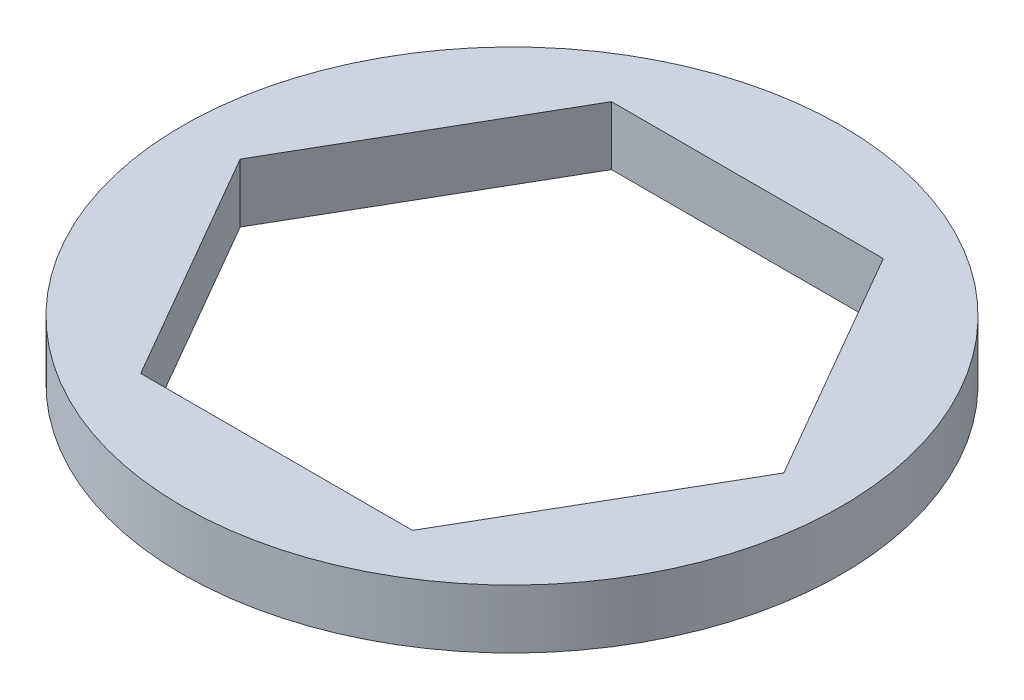
ISO-10303-21;
HEADER;
FILE_DESCRIPTION(('STEP AP214'),'2;1');
FILE_NAME('part.step','',(''),(''),'','','');
FILE_SCHEMA(('AUTOMOTIVE_DESIGN { 1 0 10303 214 1 1 1 1 }'));
ENDSEC;
DATA;
#1=APPLICATION_CONTEXT('core data for automotive mechanical design processes');
#2=APPLICATION_PROTOCOL_DEFINITION('international standard','automotive_design',2000,#1);
#3=PRODUCT_CONTEXT('',#1,'mechanical');
#4=PRODUCT('Part','Part','',(#3));
#5=PRODUCT_RELATED_PRODUCT_CATEGORY('part','',(#4));
#6=PRODUCT_DEFINITION_FORMATION('','',#4);
#7=PRODUCT_DEFINITION_CONTEXT('part definition',#1,'design');
#8=PRODUCT_DEFINITION('design','',#6,#7);
#9=PRODUCT_DEFINITION_SHAPE('','',#8);
#10=(LENGTH_UNIT() NAMED_UNIT(*) SI_UNIT(.MILLI.,.METRE.));
#11=(NAMED_UNIT(*) PLANE_ANGLE_UNIT() SI_UNIT($,.RADIAN.));
#12=(NAMED_UNIT(*) SI_UNIT($,.STERADIAN.) SOLID_ANGLE_UNIT());
#13=UNCERTAINTY_MEASURE_WITH_UNIT(LENGTH_MEASURE(1.E-05),#10,'distance_accuracy_value','');
#14=(GEOMETRIC_REPRESENTATION_CONTEXT(3) GLOBAL_UNCERTAINTY_ASSIGNED_CONTEXT((#13)) GLOBAL_UNIT_ASSIGNED_CONTEXT((#10,
#11,#12)) REPRESENTATION_CONTEXT('',''));
#15=CARTESIAN_POINT('',(0.,0.,0.));
#16=DIRECTION('',(0.,0.,1.));
#17=DIRECTION('',(1.,0.,0.));
#18=AXIS2_PLACEMENT_3D('',#15,#16,#17);
#19=CARTESIAN_POINT('',(0.,1.5875,0.));
#20=DIRECTION('',(0.,1.,0.));
#21=DIRECTION('',(0.,0.,1.));
#22=AXIS2_PLACEMENT_3D('',#19,#20,#21);
#23=PLANE('',#22);
#24=CARTESIAN_POINT('',(0.,1.5875,0.));
#25=DIRECTION('',(0.,1.,0.));
#26=DIRECTION('',(0.,0.,1.));
#27=AXIS2_PLACEMENT_3D('',#24,#25,#26);
#28=CIRCLE('',#27,8.89);
#29=CARTESIAN_POINT('',(0.,1.5875,8.89));
#30=VERTEX_POINT('',#29);
#31=EDGE_CURVE('E11',#30,#30,#28,.T.);
#32=ORIENTED_EDGE('',*,*,#31,.T.);
#33=EDGE_LOOP('',(#32));
#34=FACE_BOUND('',#33,.T.);
#35=DIRECTION('',(-0.5,0.,-0.866025403784439));
#36=VECTOR('',#35,1.);
#37=CARTESIAN_POINT('',(7.33234841870825,1.5875,0.));
#38=LINE('',#37,#36);
#39=CARTESIAN_POINT('',(7.33234841870825,1.5875,0.));
#40=VERTEX_POINT('',#39);
#41=CARTESIAN_POINT('',(3.66617420935412,1.5875,-6.35000000000001));
#42=VERTEX_POINT('',#41);
#43=EDGE_CURVE('E108',#40,#42,#38,.T.);
#44=ORIENTED_EDGE('',*,*,#43,.F.);
#45=DIRECTION('',(0.5,0.,-0.866025403784439));
#46=VECTOR('',#45,1.);
#47=CARTESIAN_POINT('',(3.66617420935413,1.5875,6.35));
#48=LINE('',#47,#46);
#49=CARTESIAN_POINT('',(3.66617420935413,1.5875,6.35));
#50=VERTEX_POINT('',#49);
#51=EDGE_CURVE('E99',#50,#40,#48,.T.);
#52=ORIENTED_EDGE('',*,*,#51,.F.);
#53=DIRECTION('',(1.,0.,0.));
#54=VECTOR('',#53,1.);
#55=CARTESIAN_POINT('',(-3.66617420935413,1.5875,6.35));
#56=LINE('',#55,#54);
#57=CARTESIAN_POINT('',(-3.66617420935413,1.5875,6.35));
#58=VERTEX_POINT('',#57);
#59=EDGE_CURVE('E133',#58,#50,#56,.T.);
#60=ORIENTED_EDGE('',*,*,#59,.F.);
#61=DIRECTION('',(0.5,0.,0.866025403784439));
#62=VECTOR('',#61,1.);
#63=CARTESIAN_POINT('',(-7.33234841870825,1.5875,0.));
#64=LINE('',#63,#62);
#65=CARTESIAN_POINT('',(-7.33234841870825,1.5875,0.));
#66=VERTEX_POINT('',#65);
#67=EDGE_CURVE('E130',#66,#58,#64,.T.);
#68=ORIENTED_EDGE('',*,*,#67,.F.);
#69=DIRECTION('',(-0.5,0.,0.866025403784439));
#70=VECTOR('',#69,1.);
#71=CARTESIAN_POINT('',(-3.66617420935413,1.5875,-6.35000000000001));
#72=LINE('',#71,#70);
#73=CARTESIAN_POINT('',(-3.66617420935413,1.5875,-6.35000000000001));
#74=VERTEX_POINT('',#73);
#75=EDGE_CURVE('E125',#74,#66,#72,.T.);
#76=ORIENTED_EDGE('',*,*,#75,.F.);
#77=DIRECTION('',(-1.,0.,0.));
#78=VECTOR('',#77,1.);
#79=CARTESIAN_POINT('',(3.66617420935412,1.5875,-6.35000000000001));
#80=LINE('',#79,#78);
#81=EDGE_CURVE('E121',#42,#74,#80,.T.);
#82=ORIENTED_EDGE('',*,*,#81,.F.);
#83=EDGE_LOOP('',(#44,#52,#60,#68,#76,#82));
#84=FACE_BOUND('',#83,.T.);
#85=ADVANCED_FACE('F45',(#34,#84),#23,.T.);
#86=CARTESIAN_POINT('',(0.,0.,0.));
#87=DIRECTION('',(0.,1.,0.));
#88=DIRECTION('',(0.,0.,1.));
#89=AXIS2_PLACEMENT_3D('',#86,#87,#88);
#90=PLANE('',#89);
#91=CARTESIAN_POINT('',(0.,0.,0.));
#92=DIRECTION('',(0.,1.,0.));
#93=DIRECTION('',(0.,0.,1.));
#94=AXIS2_PLACEMENT_3D('',#91,#92,#93);
#95=CIRCLE('',#94,8.89);
#96=CARTESIAN_POINT('',(0.,0.,8.89));
#97=VERTEX_POINT('',#96);
#98=EDGE_CURVE('E49',#97,#97,#95,.T.);
#99=ORIENTED_EDGE('',*,*,#98,.F.);
#100=EDGE_LOOP('',(#99));
#101=FACE_BOUND('',#100,.T.);
#102=DIRECTION('',(0.5,0.,-0.866025403784439));
#103=VECTOR('',#102,1.);
#104=CARTESIAN_POINT('',(3.66617420935413,0.,6.35));
#105=LINE('',#104,#103);
#106=CARTESIAN_POINT('',(3.66617420935413,0.,6.35));
#107=VERTEX_POINT('',#106);
#108=CARTESIAN_POINT('',(7.33234841870825,0.,0.));
#109=VERTEX_POINT('',#108);
#110=EDGE_CURVE('E69',#107,#109,#105,.T.);
#111=ORIENTED_EDGE('',*,*,#110,.T.);
#112=DIRECTION('',(-0.5,0.,-0.866025403784439));
#113=VECTOR('',#112,1.);
#114=CARTESIAN_POINT('',(7.33234841870825,0.,0.));
#115=LINE('',#114,#113);
#116=CARTESIAN_POINT('',(3.66617420935412,0.,-6.35000000000001));
#117=VERTEX_POINT('',#116);
#118=EDGE_CURVE('E115',#109,#117,#115,.T.);
#119=ORIENTED_EDGE('',*,*,#118,.T.);
#120=DIRECTION('',(-1.,0.,0.));
#121=VECTOR('',#120,1.);
#122=CARTESIAN_POINT('',(3.66617420935412,0.,-6.35000000000001));
#123=LINE('',#122,#121);
#124=CARTESIAN_POINT('',(-3.66617420935413,0.,-6.35000000000001));
#125=VERTEX_POINT('',#124);
#126=EDGE_CURVE('E140',#117,#125,#123,.T.);
#127=ORIENTED_EDGE('',*,*,#126,.T.);
#128=DIRECTION('',(-0.5,0.,0.866025403784439));
#129=VECTOR('',#128,1.);
#130=CARTESIAN_POINT('',(-3.66617420935413,0.,-6.35000000000001));
#131=LINE('',#130,#129);
#132=CARTESIAN_POINT('',(-7.33234841870825,0.,0.));
#133=VERTEX_POINT('',#132);
#134=EDGE_CURVE('E144',#125,#133,#131,.T.);
#135=ORIENTED_EDGE('',*,*,#134,.T.);
#136=DIRECTION('',(0.5,0.,0.866025403784439));
#137=VECTOR('',#136,1.);
#138=CARTESIAN_POINT('',(-7.33234841870825,0.,0.));
#139=LINE('',#138,#137);
#140=CARTESIAN_POINT('',(-3.66617420935413,0.,6.35));
#141=VERTEX_POINT('',#140);
#142=EDGE_CURVE('E148',#133,#141,#139,.T.);
#143=ORIENTED_EDGE('',*,*,#142,.T.);
#144=DIRECTION('',(1.,0.,0.));
#145=VECTOR('',#144,1.);
#146=CARTESIAN_POINT('',(-3.66617420935413,0.,6.35));
#147=LINE('',#146,#145);
#148=EDGE_CURVE('E109',#141,#107,#147,.T.);
#149=ORIENTED_EDGE('',*,*,#148,.T.);
#150=EDGE_LOOP('',(#111,#119,#127,#135,#143,#149));
#151=FACE_BOUND('',#150,.T.);
#152=ADVANCED_FACE('F172',(#101,#151),#90,.F.);
#153=CARTESIAN_POINT('',(0.,1.5875,0.));
#154=DIRECTION('',(0.,-1.,0.));
#155=DIRECTION('',(0.,0.,-1.));
#156=AXIS2_PLACEMENT_3D('',#153,#154,#155);
#157=CYLINDRICAL_SURFACE('',#156,8.89);
#158=ORIENTED_EDGE('',*,*,#31,.F.);
#159=EDGE_LOOP('',(#158));
#160=FACE_BOUND('',#159,.T.);
#161=ORIENTED_EDGE('',*,*,#98,.T.);
#162=EDGE_LOOP('',(#161));
#163=FACE_BOUND('',#162,.T.);
#164=ADVANCED_FACE('F47',(#160,#163),#157,.T.);
#165=CARTESIAN_POINT('',(3.66617420935413,1.5875,6.35));
#166=DIRECTION('',(-0.866025403784439,0.,-0.5));
#167=DIRECTION('',(-0.5,0.,0.866025403784439));
#168=AXIS2_PLACEMENT_3D('',#165,#166,#167);
#169=PLANE('',#168);
#170=ORIENTED_EDGE('',*,*,#110,.F.);
#171=DIRECTION('',(0.,-1.,0.));
#172=VECTOR('',#171,1.);
#173=CARTESIAN_POINT('',(3.66617420935413,1.5875,6.35));
#174=LINE('',#173,#172);
#175=EDGE_CURVE('E103',#50,#107,#174,.T.);
#176=ORIENTED_EDGE('',*,*,#175,.F.);
#177=ORIENTED_EDGE('',*,*,#51,.T.);
#178=DIRECTION('',(0.,-1.,0.));
#179=VECTOR('',#178,1.);
#180=CARTESIAN_POINT('',(7.33234841870825,1.5875,0.));
#181=LINE('',#180,#179);
#182=EDGE_CURVE('E102',#40,#109,#181,.T.);
#183=ORIENTED_EDGE('',*,*,#182,.T.);
#184=EDGE_LOOP('',(#170,#176,#177,#183));
#185=FACE_BOUND('',#184,.T.);
#186=ADVANCED_FACE('F101',(#185),#169,.T.);
#187=CARTESIAN_POINT('',(7.33234841870825,1.5875,0.));
#188=DIRECTION('',(-0.866025403784439,0.,0.5));
#189=DIRECTION('',(0.5,0.,0.866025403784439));
#190=AXIS2_PLACEMENT_3D('',#187,#188,#189);
#191=PLANE('',#190);
#192=ORIENTED_EDGE('',*,*,#118,.F.);
#193=ORIENTED_EDGE('',*,*,#182,.F.);
#194=ORIENTED_EDGE('',*,*,#43,.T.);
#195=DIRECTION('',(0.,-1.,0.));
#196=VECTOR('',#195,1.);
#197=CARTESIAN_POINT('',(3.66617420935412,1.5875,-6.35000000000001));
#198=LINE('',#197,#196);
#199=EDGE_CURVE('E117',#42,#117,#198,.T.);
#200=ORIENTED_EDGE('',*,*,#199,.T.);
#201=EDGE_LOOP('',(#192,#193,#194,#200));
#202=FACE_BOUND('',#201,.T.);
#203=ADVANCED_FACE('F112',(#202),#191,.T.);
#204=CARTESIAN_POINT('',(3.66617420935412,1.5875,-6.35000000000001));
#205=DIRECTION('',(0.,0.,1.));
#206=DIRECTION('',(1.,0.,0.));
#207=AXIS2_PLACEMENT_3D('',#204,#205,#206);
#208=PLANE('',#207);
#209=ORIENTED_EDGE('',*,*,#126,.F.);
#210=ORIENTED_EDGE('',*,*,#199,.F.);
#211=ORIENTED_EDGE('',*,*,#81,.T.);
#212=DIRECTION('',(0.,-1.,0.));
#213=VECTOR('',#212,1.);
#214=CARTESIAN_POINT('',(-3.66617420935413,1.5875,-6.35000000000001));
#215=LINE('',#214,#213);
#216=EDGE_CURVE('E162',#74,#125,#215,.T.);
#217=ORIENTED_EDGE('',*,*,#216,.T.);
#218=EDGE_LOOP('',(#209,#210,#211,#217));
#219=FACE_BOUND('',#218,.T.);
#220=ADVANCED_FACE('F168',(#219),#208,.T.);
#221=CARTESIAN_POINT('',(-3.66617420935413,1.5875,-6.35000000000001));
#222=DIRECTION('',(0.866025403784439,0.,0.5));
#223=DIRECTION('',(0.5,0.,-0.866025403784439));
#224=AXIS2_PLACEMENT_3D('',#221,#222,#223);
#225=PLANE('',#224);
#226=ORIENTED_EDGE('',*,*,#134,.F.);
#227=ORIENTED_EDGE('',*,*,#216,.F.);
#228=ORIENTED_EDGE('',*,*,#75,.T.);
#229=DIRECTION('',(0.,-1.,0.));
#230=VECTOR('',#229,1.);
#231=CARTESIAN_POINT('',(-7.33234841870825,1.5875,0.));
#232=LINE('',#231,#230);
#233=EDGE_CURVE('E159',#66,#133,#232,.T.);
#234=ORIENTED_EDGE('',*,*,#233,.T.);
#235=EDGE_LOOP('',(#226,#227,#228,#234));
#236=FACE_BOUND('',#235,.T.);
#237=ADVANCED_FACE('F180',(#236),#225,.T.);
#238=CARTESIAN_POINT('',(-7.33234841870825,1.5875,0.));
#239=DIRECTION('',(0.866025403784439,0.,-0.5));
#240=DIRECTION('',(-0.5,0.,-0.866025403784439));
#241=AXIS2_PLACEMENT_3D('',#238,#239,#240);
#242=PLANE('',#241);
#243=ORIENTED_EDGE('',*,*,#142,.F.);
#244=ORIENTED_EDGE('',*,*,#233,.F.);
#245=ORIENTED_EDGE('',*,*,#67,.T.);
#246=DIRECTION('',(0.,-1.,0.));
#247=VECTOR('',#246,1.);
#248=CARTESIAN_POINT('',(-3.66617420935413,1.5875,6.35));
#249=LINE('',#248,#247);
#250=EDGE_CURVE('E61',#58,#141,#249,.T.);
#251=ORIENTED_EDGE('',*,*,#250,.T.);
#252=EDGE_LOOP('',(#243,#244,#245,#251));
#253=FACE_BOUND('',#252,.T.);
#254=ADVANCED_FACE('F178',(#253),#242,.T.);
#255=CARTESIAN_POINT('',(-3.66617420935413,1.5875,6.35));
#256=DIRECTION('',(0.,0.,-1.));
#257=DIRECTION('',(-1.,0.,0.));
#258=AXIS2_PLACEMENT_3D('',#255,#256,#257);
#259=PLANE('',#258);
#260=ORIENTED_EDGE('',*,*,#148,.F.);
#261=ORIENTED_EDGE('',*,*,#250,.F.);
#262=ORIENTED_EDGE('',*,*,#59,.T.);
#263=ORIENTED_EDGE('',*,*,#175,.T.);
#264=EDGE_LOOP('',(#260,#261,#262,#263));
#265=FACE_BOUND('',#264,.T.);
#266=ADVANCED_FACE('F174',(#265),#259,.T.);
#267=CLOSED_SHELL('',(#85,#152,#164,#186,#203,#220,#237,#254,#266));
#268=MANIFOLD_SOLID_BREP('B2',#267);
#269=ADVANCED_BREP_SHAPE_REPRESENTATION('',(#18,#268),#14);
#270=SHAPE_DEFINITION_REPRESENTATION(#9,#269);
ENDSEC;
END-ISO-10303-21;
